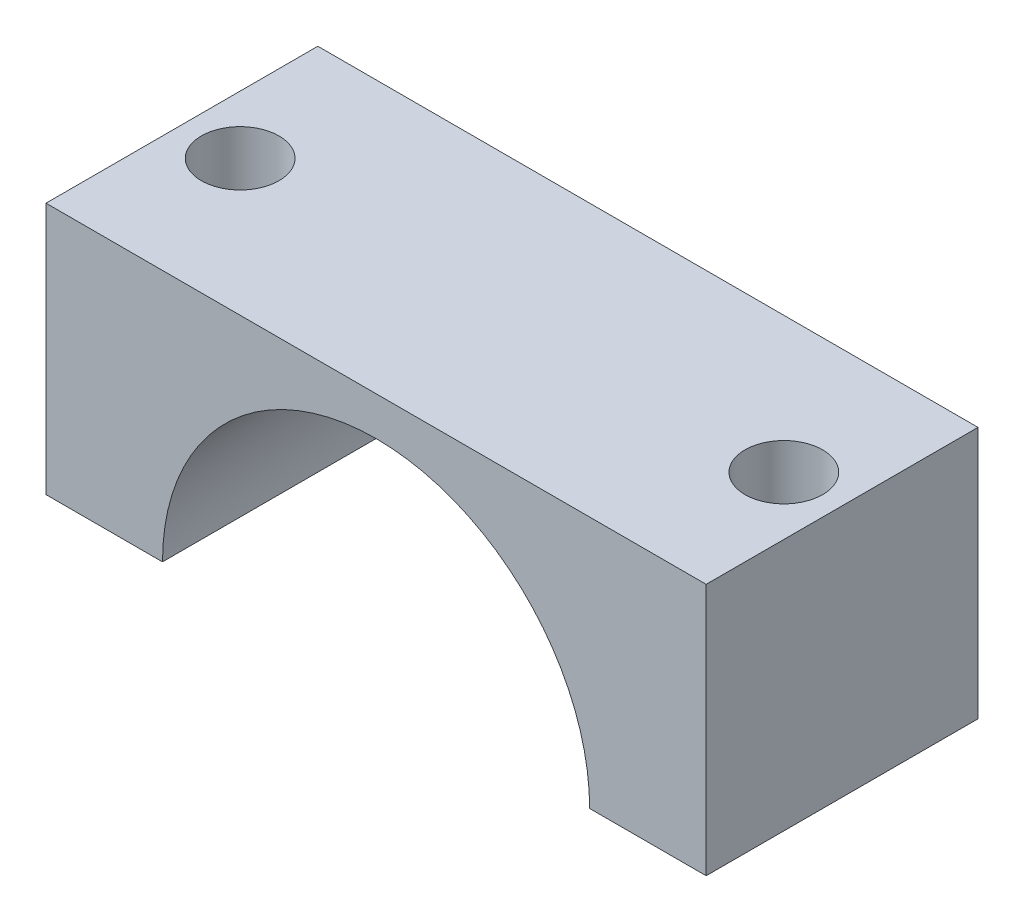
ISO-10303-21;
HEADER;
FILE_DESCRIPTION(('STEP AP214'),'2;1');
FILE_NAME('part.step','',(''),(''),'','','');
FILE_SCHEMA(('AUTOMOTIVE_DESIGN { 1 0 10303 214 1 1 1 1 }'));
ENDSEC;
DATA;
#1=APPLICATION_CONTEXT('core data for automotive mechanical design processes');
#2=APPLICATION_PROTOCOL_DEFINITION('international standard','automotive_design',2000,#1);
#3=PRODUCT_CONTEXT('',#1,'mechanical');
#4=PRODUCT('Part','Part','',(#3));
#5=PRODUCT_RELATED_PRODUCT_CATEGORY('part','',(#4));
#6=PRODUCT_DEFINITION_FORMATION('','',#4);
#7=PRODUCT_DEFINITION_CONTEXT('part definition',#1,'design');
#8=PRODUCT_DEFINITION('design','',#6,#7);
#9=PRODUCT_DEFINITION_SHAPE('','',#8);
#10=(LENGTH_UNIT() NAMED_UNIT(*) SI_UNIT(.MILLI.,.METRE.));
#11=(NAMED_UNIT(*) PLANE_ANGLE_UNIT() SI_UNIT($,.RADIAN.));
#12=(NAMED_UNIT(*) SI_UNIT($,.STERADIAN.) SOLID_ANGLE_UNIT());
#13=UNCERTAINTY_MEASURE_WITH_UNIT(LENGTH_MEASURE(1.E-05),#10,'distance_accuracy_value','');
#14=(GEOMETRIC_REPRESENTATION_CONTEXT(3) GLOBAL_UNCERTAINTY_ASSIGNED_CONTEXT((#13)) GLOBAL_UNIT_ASSIGNED_CONTEXT((#10,
#11,#12)) REPRESENTATION_CONTEXT('',''));
#15=CARTESIAN_POINT('',(0.,0.,0.));
#16=DIRECTION('',(0.,0.,1.));
#17=DIRECTION('',(1.,0.,0.));
#18=AXIS2_PLACEMENT_3D('',#15,#16,#17);
#19=CARTESIAN_POINT('',(-17.,13.,14.));
#20=DIRECTION('',(0.,-1.,0.));
#21=DIRECTION('',(0.,0.,-1.));
#22=AXIS2_PLACEMENT_3D('',#19,#20,#21);
#23=PLANE('',#22);
#24=CARTESIAN_POINT('',(-14.,13.,7.));
#25=DIRECTION('',(0.,1.,0.));
#26=DIRECTION('',(0.,0.,-1.));
#27=AXIS2_PLACEMENT_3D('',#24,#25,#26);
#28=CIRCLE('',#27,2.);
#29=CARTESIAN_POINT('',(-14.,13.,5.));
#30=VERTEX_POINT('',#29);
#31=EDGE_CURVE('E159',#30,#30,#28,.T.);
#32=ORIENTED_EDGE('',*,*,#31,.F.);
#33=EDGE_LOOP('',(#32));
#34=FACE_BOUND('',#33,.T.);
#35=CARTESIAN_POINT('',(14.,13.,7.));
#36=DIRECTION('',(0.,1.,0.));
#37=DIRECTION('',(0.,0.,1.));
#38=AXIS2_PLACEMENT_3D('',#35,#36,#37);
#39=CIRCLE('',#38,2.);
#40=CARTESIAN_POINT('',(14.,13.,9.));
#41=VERTEX_POINT('',#40);
#42=EDGE_CURVE('E162',#41,#41,#39,.T.);
#43=ORIENTED_EDGE('',*,*,#42,.F.);
#44=EDGE_LOOP('',(#43));
#45=FACE_BOUND('',#44,.T.);
#46=DIRECTION('',(-1.,0.,0.));
#47=VECTOR('',#46,1.);
#48=CARTESIAN_POINT('',(-17.,13.,0.));
#49=LINE('',#48,#47);
#50=CARTESIAN_POINT('',(17.,13.,0.));
#51=VERTEX_POINT('',#50);
#52=CARTESIAN_POINT('',(-17.,13.,0.));
#53=VERTEX_POINT('',#52);
#54=EDGE_CURVE('E115',#51,#53,#49,.T.);
#55=ORIENTED_EDGE('',*,*,#54,.T.);
#56=DIRECTION('',(0.,0.,-1.));
#57=VECTOR('',#56,1.);
#58=CARTESIAN_POINT('',(-17.,13.,14.));
#59=LINE('',#58,#57);
#60=CARTESIAN_POINT('',(-17.,13.,14.));
#61=VERTEX_POINT('',#60);
#62=EDGE_CURVE('E11',#61,#53,#59,.T.);
#63=ORIENTED_EDGE('',*,*,#62,.F.);
#64=DIRECTION('',(-1.,0.,0.));
#65=VECTOR('',#64,1.);
#66=CARTESIAN_POINT('',(-17.,13.,14.));
#67=LINE('',#66,#65);
#68=CARTESIAN_POINT('',(17.,13.,14.));
#69=VERTEX_POINT('',#68);
#70=EDGE_CURVE('E126',#69,#61,#67,.T.);
#71=ORIENTED_EDGE('',*,*,#70,.F.);
#72=DIRECTION('',(0.,0.,-1.));
#73=VECTOR('',#72,1.);
#74=CARTESIAN_POINT('',(17.,13.,14.));
#75=LINE('',#74,#73);
#76=EDGE_CURVE('E111',#69,#51,#75,.T.);
#77=ORIENTED_EDGE('',*,*,#76,.T.);
#78=EDGE_LOOP('',(#55,#63,#71,#77));
#79=FACE_BOUND('',#78,.T.);
#80=ADVANCED_FACE('F31',(#34,#45,#79),#23,.F.);
#81=CARTESIAN_POINT('',(-17.,0.,14.));
#82=DIRECTION('',(1.,0.,0.));
#83=DIRECTION('',(0.,0.,-1.));
#84=AXIS2_PLACEMENT_3D('',#81,#82,#83);
#85=PLANE('',#84);
#86=DIRECTION('',(0.,-1.,0.));
#87=VECTOR('',#86,1.);
#88=CARTESIAN_POINT('',(-17.,0.,0.));
#89=LINE('',#88,#87);
#90=CARTESIAN_POINT('',(-17.,0.,0.));
#91=VERTEX_POINT('',#90);
#92=EDGE_CURVE('E118',#53,#91,#89,.T.);
#93=ORIENTED_EDGE('',*,*,#92,.T.);
#94=DIRECTION('',(0.,0.,-1.));
#95=VECTOR('',#94,1.);
#96=CARTESIAN_POINT('',(-17.,0.,14.));
#97=LINE('',#96,#95);
#98=CARTESIAN_POINT('',(-17.,0.,14.));
#99=VERTEX_POINT('',#98);
#100=EDGE_CURVE('E39',#99,#91,#97,.T.);
#101=ORIENTED_EDGE('',*,*,#100,.F.);
#102=DIRECTION('',(0.,-1.,0.));
#103=VECTOR('',#102,1.);
#104=CARTESIAN_POINT('',(-17.,0.,14.));
#105=LINE('',#104,#103);
#106=EDGE_CURVE('E84',#61,#99,#105,.T.);
#107=ORIENTED_EDGE('',*,*,#106,.F.);
#108=ORIENTED_EDGE('',*,*,#62,.T.);
#109=EDGE_LOOP('',(#93,#101,#107,#108));
#110=FACE_BOUND('',#109,.T.);
#111=ADVANCED_FACE('F151',(#110),#85,.F.);
#112=CARTESIAN_POINT('',(-17.,0.,14.));
#113=DIRECTION('',(0.,1.,0.));
#114=DIRECTION('',(0.,0.,1.));
#115=AXIS2_PLACEMENT_3D('',#112,#113,#114);
#116=PLANE('',#115);
#117=CARTESIAN_POINT('',(-14.,0.,7.));
#118=DIRECTION('',(0.,1.,0.));
#119=DIRECTION('',(0.,0.,-1.));
#120=AXIS2_PLACEMENT_3D('',#117,#118,#119);
#121=CIRCLE('',#120,2.);
#122=CARTESIAN_POINT('',(-14.,0.,5.));
#123=VERTEX_POINT('',#122);
#124=EDGE_CURVE('E164',#123,#123,#121,.T.);
#125=ORIENTED_EDGE('',*,*,#124,.T.);
#126=EDGE_LOOP('',(#125));
#127=FACE_BOUND('',#126,.T.);
#128=DIRECTION('',(1.,0.,0.));
#129=VECTOR('',#128,1.);
#130=CARTESIAN_POINT('',(-17.,0.,0.));
#131=LINE('',#130,#129);
#132=CARTESIAN_POINT('',(-11.,0.,0.));
#133=VERTEX_POINT('',#132);
#134=EDGE_CURVE('E121',#91,#133,#131,.T.);
#135=ORIENTED_EDGE('',*,*,#134,.T.);
#136=DIRECTION('',(0.,0.,-1.));
#137=VECTOR('',#136,1.);
#138=CARTESIAN_POINT('',(-11.,0.,14.));
#139=LINE('',#138,#137);
#140=CARTESIAN_POINT('',(-11.,0.,14.));
#141=VERTEX_POINT('',#140);
#142=EDGE_CURVE('E106',#141,#133,#139,.T.);
#143=ORIENTED_EDGE('',*,*,#142,.F.);
#144=DIRECTION('',(1.,0.,0.));
#145=VECTOR('',#144,1.);
#146=CARTESIAN_POINT('',(-17.,0.,14.));
#147=LINE('',#146,#145);
#148=EDGE_CURVE('E97',#99,#141,#147,.T.);
#149=ORIENTED_EDGE('',*,*,#148,.F.);
#150=ORIENTED_EDGE('',*,*,#100,.T.);
#151=EDGE_LOOP('',(#135,#143,#149,#150));
#152=FACE_BOUND('',#151,.T.);
#153=ADVANCED_FACE('F132',(#127,#152),#116,.F.);
#154=CARTESIAN_POINT('',(0.,0.,14.));
#155=DIRECTION('',(0.,0.,-1.));
#156=DIRECTION('',(-1.,0.,0.));
#157=AXIS2_PLACEMENT_3D('',#154,#155,#156);
#158=CYLINDRICAL_SURFACE('',#157,11.);
#159=CARTESIAN_POINT('',(0.,0.,0.));
#160=DIRECTION('',(0.,0.,-1.));
#161=DIRECTION('',(1.,0.,0.));
#162=AXIS2_PLACEMENT_3D('',#159,#160,#161);
#163=CIRCLE('',#162,11.);
#164=CARTESIAN_POINT('',(11.,0.,0.));
#165=VERTEX_POINT('',#164);
#166=EDGE_CURVE('E105',#133,#165,#163,.T.);
#167=ORIENTED_EDGE('',*,*,#166,.T.);
#168=DIRECTION('',(0.,0.,-1.));
#169=VECTOR('',#168,1.);
#170=CARTESIAN_POINT('',(11.,0.,14.));
#171=LINE('',#170,#169);
#172=CARTESIAN_POINT('',(11.,0.,14.));
#173=VERTEX_POINT('',#172);
#174=EDGE_CURVE('E102',#173,#165,#171,.T.);
#175=ORIENTED_EDGE('',*,*,#174,.F.);
#176=CARTESIAN_POINT('',(0.,0.,14.));
#177=DIRECTION('',(0.,0.,-1.));
#178=DIRECTION('',(1.,0.,0.));
#179=AXIS2_PLACEMENT_3D('',#176,#177,#178);
#180=CIRCLE('',#179,11.);
#181=EDGE_CURVE('E91',#141,#173,#180,.T.);
#182=ORIENTED_EDGE('',*,*,#181,.F.);
#183=ORIENTED_EDGE('',*,*,#142,.T.);
#184=EDGE_LOOP('',(#167,#175,#182,#183));
#185=FACE_BOUND('',#184,.T.);
#186=ADVANCED_FACE('F103',(#185),#158,.F.);
#187=CARTESIAN_POINT('',(11.,0.,14.));
#188=DIRECTION('',(0.,1.,0.));
#189=DIRECTION('',(0.,0.,1.));
#190=AXIS2_PLACEMENT_3D('',#187,#188,#189);
#191=PLANE('',#190);
#192=CARTESIAN_POINT('',(14.,0.,7.));
#193=DIRECTION('',(0.,1.,0.));
#194=DIRECTION('',(0.,0.,1.));
#195=AXIS2_PLACEMENT_3D('',#192,#193,#194);
#196=CIRCLE('',#195,2.);
#197=CARTESIAN_POINT('',(14.,0.,9.));
#198=VERTEX_POINT('',#197);
#199=EDGE_CURVE('E119',#198,#198,#196,.T.);
#200=ORIENTED_EDGE('',*,*,#199,.T.);
#201=EDGE_LOOP('',(#200));
#202=FACE_BOUND('',#201,.T.);
#203=DIRECTION('',(1.,0.,0.));
#204=VECTOR('',#203,1.);
#205=CARTESIAN_POINT('',(11.,0.,0.));
#206=LINE('',#205,#204);
#207=CARTESIAN_POINT('',(17.,0.,0.));
#208=VERTEX_POINT('',#207);
#209=EDGE_CURVE('E70',#165,#208,#206,.T.);
#210=ORIENTED_EDGE('',*,*,#209,.T.);
#211=DIRECTION('',(0.,0.,-1.));
#212=VECTOR('',#211,1.);
#213=CARTESIAN_POINT('',(17.,0.,14.));
#214=LINE('',#213,#212);
#215=CARTESIAN_POINT('',(17.,0.,14.));
#216=VERTEX_POINT('',#215);
#217=EDGE_CURVE('E107',#216,#208,#214,.T.);
#218=ORIENTED_EDGE('',*,*,#217,.F.);
#219=DIRECTION('',(1.,0.,0.));
#220=VECTOR('',#219,1.);
#221=CARTESIAN_POINT('',(11.,0.,14.));
#222=LINE('',#221,#220);
#223=EDGE_CURVE('E95',#173,#216,#222,.T.);
#224=ORIENTED_EDGE('',*,*,#223,.F.);
#225=ORIENTED_EDGE('',*,*,#174,.T.);
#226=EDGE_LOOP('',(#210,#218,#224,#225));
#227=FACE_BOUND('',#226,.T.);
#228=ADVANCED_FACE('F109',(#202,#227),#191,.F.);
#229=CARTESIAN_POINT('',(17.,0.,14.));
#230=DIRECTION('',(-1.,0.,0.));
#231=DIRECTION('',(0.,0.,1.));
#232=AXIS2_PLACEMENT_3D('',#229,#230,#231);
#233=PLANE('',#232);
#234=DIRECTION('',(0.,1.,0.));
#235=VECTOR('',#234,1.);
#236=CARTESIAN_POINT('',(17.,0.,0.));
#237=LINE('',#236,#235);
#238=EDGE_CURVE('E76',#208,#51,#237,.T.);
#239=ORIENTED_EDGE('',*,*,#238,.T.);
#240=ORIENTED_EDGE('',*,*,#76,.F.);
#241=DIRECTION('',(0.,1.,0.));
#242=VECTOR('',#241,1.);
#243=CARTESIAN_POINT('',(17.,0.,14.));
#244=LINE('',#243,#242);
#245=EDGE_CURVE('E47',#216,#69,#244,.T.);
#246=ORIENTED_EDGE('',*,*,#245,.F.);
#247=ORIENTED_EDGE('',*,*,#217,.T.);
#248=EDGE_LOOP('',(#239,#240,#246,#247));
#249=FACE_BOUND('',#248,.T.);
#250=ADVANCED_FACE('F139',(#249),#233,.F.);
#251=CARTESIAN_POINT('',(0.,0.,14.));
#252=DIRECTION('',(0.,0.,1.));
#253=DIRECTION('',(1.,0.,0.));
#254=AXIS2_PLACEMENT_3D('',#251,#252,#253);
#255=PLANE('',#254);
#256=ORIENTED_EDGE('',*,*,#70,.T.);
#257=ORIENTED_EDGE('',*,*,#106,.T.);
#258=ORIENTED_EDGE('',*,*,#148,.T.);
#259=ORIENTED_EDGE('',*,*,#181,.T.);
#260=ORIENTED_EDGE('',*,*,#223,.T.);
#261=ORIENTED_EDGE('',*,*,#245,.T.);
#262=EDGE_LOOP('',(#256,#257,#258,#259,#260,#261));
#263=FACE_BOUND('',#262,.T.);
#264=ADVANCED_FACE('F93',(#263),#255,.T.);
#265=CARTESIAN_POINT('',(0.,0.,0.));
#266=DIRECTION('',(0.,0.,1.));
#267=DIRECTION('',(1.,0.,0.));
#268=AXIS2_PLACEMENT_3D('',#265,#266,#267);
#269=PLANE('',#268);
#270=ORIENTED_EDGE('',*,*,#54,.F.);
#271=ORIENTED_EDGE('',*,*,#238,.F.);
#272=ORIENTED_EDGE('',*,*,#209,.F.);
#273=ORIENTED_EDGE('',*,*,#166,.F.);
#274=ORIENTED_EDGE('',*,*,#134,.F.);
#275=ORIENTED_EDGE('',*,*,#92,.F.);
#276=EDGE_LOOP('',(#270,#271,#272,#273,#274,#275));
#277=FACE_BOUND('',#276,.T.);
#278=ADVANCED_FACE('F135',(#277),#269,.F.);
#279=CARTESIAN_POINT('',(14.,0.,7.));
#280=DIRECTION('',(0.,1.,0.));
#281=DIRECTION('',(0.,0.,1.));
#282=AXIS2_PLACEMENT_3D('',#279,#280,#281);
#283=CYLINDRICAL_SURFACE('',#282,2.);
#284=ORIENTED_EDGE('',*,*,#199,.F.);
#285=EDGE_LOOP('',(#284));
#286=FACE_BOUND('',#285,.T.);
#287=ORIENTED_EDGE('',*,*,#42,.T.);
#288=EDGE_LOOP('',(#287));
#289=FACE_BOUND('',#288,.T.);
#290=ADVANCED_FACE('F176',(#286,#289),#283,.F.);
#291=CARTESIAN_POINT('',(-14.,0.,7.));
#292=DIRECTION('',(0.,1.,0.));
#293=DIRECTION('',(0.,0.,1.));
#294=AXIS2_PLACEMENT_3D('',#291,#292,#293);
#295=CYLINDRICAL_SURFACE('',#294,2.);
#296=ORIENTED_EDGE('',*,*,#124,.F.);
#297=EDGE_LOOP('',(#296));
#298=FACE_BOUND('',#297,.T.);
#299=ORIENTED_EDGE('',*,*,#31,.T.);
#300=EDGE_LOOP('',(#299));
#301=FACE_BOUND('',#300,.T.);
#302=ADVANCED_FACE('F174',(#298,#301),#295,.F.);
#303=CLOSED_SHELL('',(#80,#111,#153,#186,#228,#250,#264,#278,#290,#302));
#304=MANIFOLD_SOLID_BREP('B2',#303);
#305=ADVANCED_BREP_SHAPE_REPRESENTATION('',(#18,#304),#14);
#306=SHAPE_DEFINITION_REPRESENTATION(#9,#305);
ENDSEC;
END-ISO-10303-21;
